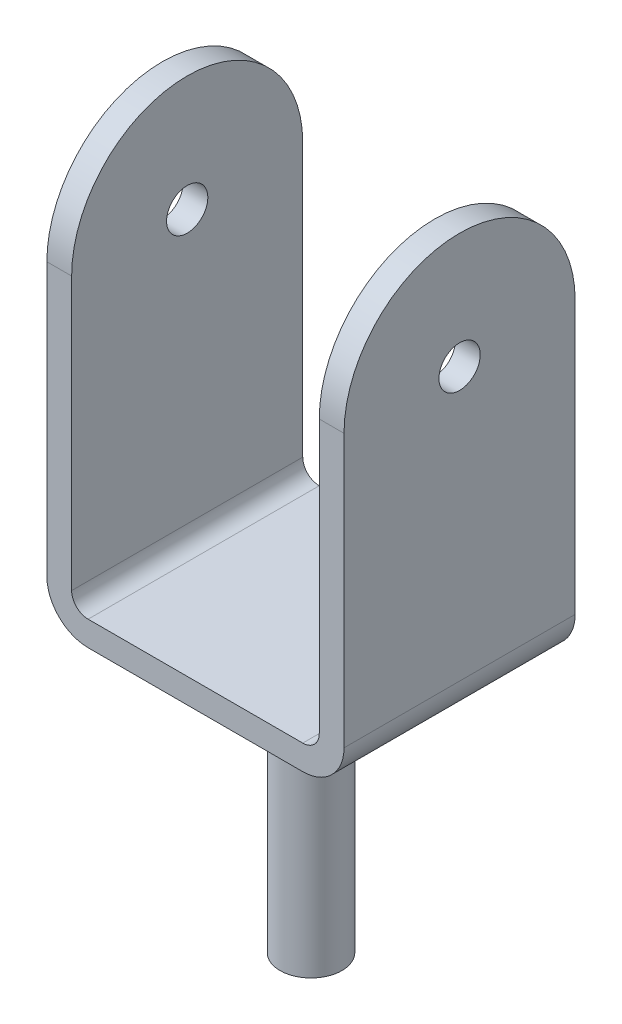
ISO-10303-21;
HEADER;
FILE_DESCRIPTION(('STEP AP214'),'2;1');
FILE_NAME('part.step','',(''),(''),'','','');
FILE_SCHEMA(('AUTOMOTIVE_DESIGN { 1 0 10303 214 1 1 1 1 }'));
ENDSEC;
DATA;
#1=APPLICATION_CONTEXT('core data for automotive mechanical design processes');
#2=APPLICATION_PROTOCOL_DEFINITION('international standard','automotive_design',2000,#1);
#3=PRODUCT_CONTEXT('',#1,'mechanical');
#4=PRODUCT('Part','Part','',(#3));
#5=PRODUCT_RELATED_PRODUCT_CATEGORY('part','',(#4));
#6=PRODUCT_DEFINITION_FORMATION('','',#4);
#7=PRODUCT_DEFINITION_CONTEXT('part definition',#1,'design');
#8=PRODUCT_DEFINITION('design','',#6,#7);
#9=PRODUCT_DEFINITION_SHAPE('','',#8);
#10=(LENGTH_UNIT() NAMED_UNIT(*) SI_UNIT(.MILLI.,.METRE.));
#11=(NAMED_UNIT(*) PLANE_ANGLE_UNIT() SI_UNIT($,.RADIAN.));
#12=(NAMED_UNIT(*) SI_UNIT($,.STERADIAN.) SOLID_ANGLE_UNIT());
#13=UNCERTAINTY_MEASURE_WITH_UNIT(LENGTH_MEASURE(1.E-05),#10,'distance_accuracy_value','');
#14=(GEOMETRIC_REPRESENTATION_CONTEXT(3) GLOBAL_UNCERTAINTY_ASSIGNED_CONTEXT((#13)) GLOBAL_UNIT_ASSIGNED_CONTEXT((#10,
#11,#12)) REPRESENTATION_CONTEXT('',''));
#15=CARTESIAN_POINT('',(0.,0.,0.));
#16=DIRECTION('',(0.,0.,1.));
#17=DIRECTION('',(1.,0.,0.));
#18=AXIS2_PLACEMENT_3D('',#15,#16,#17);
#19=CARTESIAN_POINT('',(180.,845.,140.));
#20=DIRECTION('',(-1.,0.,0.));
#21=DIRECTION('',(0.,0.,1.));
#22=AXIS2_PLACEMENT_3D('',#19,#20,#21);
#23=PLANE('',#22);
#24=CARTESIAN_POINT('',(180.,705.,0.));
#25=DIRECTION('',(1.,0.,0.));
#26=DIRECTION('',(0.,0.,-1.));
#27=AXIS2_PLACEMENT_3D('',#24,#25,#26);
#28=CIRCLE('',#27,25.);
#29=CARTESIAN_POINT('',(180.,705.,-25.));
#30=VERTEX_POINT('',#29);
#31=EDGE_CURVE('E262',#30,#30,#28,.T.);
#32=ORIENTED_EDGE('',*,*,#31,.F.);
#33=EDGE_LOOP('',(#32));
#34=FACE_BOUND('',#33,.T.);
#35=DIRECTION('',(0.,-1.,0.));
#36=VECTOR('',#35,1.);
#37=CARTESIAN_POINT('',(180.,845.,-140.));
#38=LINE('',#37,#36);
#39=CARTESIAN_POINT('',(180.,705.,-140.));
#40=VERTEX_POINT('',#39);
#41=CARTESIAN_POINT('',(180.,375.,-140.));
#42=VERTEX_POINT('',#41);
#43=EDGE_CURVE('E161',#40,#42,#38,.T.);
#44=ORIENTED_EDGE('',*,*,#43,.F.);
#45=CARTESIAN_POINT('',(180.,705.,0.));
#46=DIRECTION('',(1.,0.,0.));
#47=DIRECTION('',(0.,0.,-1.));
#48=AXIS2_PLACEMENT_3D('',#45,#46,#47);
#49=CIRCLE('',#48,140.);
#50=CARTESIAN_POINT('',(180.,705.,140.));
#51=VERTEX_POINT('',#50);
#52=EDGE_CURVE('E146',#40,#51,#49,.T.);
#53=ORIENTED_EDGE('',*,*,#52,.T.);
#54=DIRECTION('',(0.,-1.,0.));
#55=VECTOR('',#54,1.);
#56=CARTESIAN_POINT('',(180.,845.,140.));
#57=LINE('',#56,#55);
#58=CARTESIAN_POINT('',(180.,375.,140.));
#59=VERTEX_POINT('',#58);
#60=EDGE_CURVE('E233',#51,#59,#57,.T.);
#61=ORIENTED_EDGE('',*,*,#60,.T.);
#62=DIRECTION('',(0.,0.,-1.));
#63=VECTOR('',#62,1.);
#64=CARTESIAN_POINT('',(180.,375.,-140.));
#65=LINE('',#64,#63);
#66=EDGE_CURVE('E169',#59,#42,#65,.T.);
#67=ORIENTED_EDGE('',*,*,#66,.T.);
#68=EDGE_LOOP('',(#44,#53,#61,#67));
#69=FACE_BOUND('',#68,.T.);
#70=ADVANCED_FACE('F57',(#34,#69),#23,.F.);
#71=CARTESIAN_POINT('',(-180.,845.,140.));
#72=DIRECTION('',(1.,0.,0.));
#73=DIRECTION('',(0.,0.,-1.));
#74=AXIS2_PLACEMENT_3D('',#71,#72,#73);
#75=PLANE('',#74);
#76=CARTESIAN_POINT('',(-180.,705.,0.));
#77=DIRECTION('',(1.,0.,0.));
#78=DIRECTION('',(0.,0.,-1.));
#79=AXIS2_PLACEMENT_3D('',#76,#77,#78);
#80=CIRCLE('',#79,25.);
#81=CARTESIAN_POINT('',(-180.,705.,-25.));
#82=VERTEX_POINT('',#81);
#83=EDGE_CURVE('E165',#82,#82,#80,.T.);
#84=ORIENTED_EDGE('',*,*,#83,.T.);
#85=EDGE_LOOP('',(#84));
#86=FACE_BOUND('',#85,.T.);
#87=CARTESIAN_POINT('',(-180.,705.,0.));
#88=DIRECTION('',(1.,0.,0.));
#89=DIRECTION('',(0.,0.,-1.));
#90=AXIS2_PLACEMENT_3D('',#87,#88,#89);
#91=CIRCLE('',#90,140.);
#92=CARTESIAN_POINT('',(-180.,705.,-140.));
#93=VERTEX_POINT('',#92);
#94=CARTESIAN_POINT('',(-180.,705.,140.));
#95=VERTEX_POINT('',#94);
#96=EDGE_CURVE('E252',#93,#95,#91,.T.);
#97=ORIENTED_EDGE('',*,*,#96,.F.);
#98=DIRECTION('',(0.,-1.,0.));
#99=VECTOR('',#98,1.);
#100=CARTESIAN_POINT('',(-180.,845.,-140.));
#101=LINE('',#100,#99);
#102=CARTESIAN_POINT('',(-180.,375.,-140.));
#103=VERTEX_POINT('',#102);
#104=EDGE_CURVE('E171',#93,#103,#101,.T.);
#105=ORIENTED_EDGE('',*,*,#104,.T.);
#106=DIRECTION('',(0.,0.,1.));
#107=VECTOR('',#106,1.);
#108=CARTESIAN_POINT('',(-180.,375.,140.));
#109=LINE('',#108,#107);
#110=CARTESIAN_POINT('',(-180.,375.,140.));
#111=VERTEX_POINT('',#110);
#112=EDGE_CURVE('E66',#103,#111,#109,.T.);
#113=ORIENTED_EDGE('',*,*,#112,.T.);
#114=DIRECTION('',(0.,-1.,0.));
#115=VECTOR('',#114,1.);
#116=CARTESIAN_POINT('',(-180.,845.,140.));
#117=LINE('',#116,#115);
#118=EDGE_CURVE('E79',#95,#111,#117,.T.);
#119=ORIENTED_EDGE('',*,*,#118,.F.);
#120=EDGE_LOOP('',(#97,#105,#113,#119));
#121=FACE_BOUND('',#120,.T.);
#122=ADVANCED_FACE('F219',(#86,#121),#75,.F.);
#123=CARTESIAN_POINT('',(150.,0.,-227.));
#124=DIRECTION('',(-1.,0.,0.));
#125=DIRECTION('',(0.,-1.,0.));
#126=AXIS2_PLACEMENT_3D('',#123,#124,#125);
#127=PLANE('',#126);
#128=CARTESIAN_POINT('',(150.,705.,0.));
#129=DIRECTION('',(-1.,0.,0.));
#130=DIRECTION('',(0.,-1.,0.));
#131=AXIS2_PLACEMENT_3D('',#128,#129,#130);
#132=CIRCLE('',#131,25.);
#133=CARTESIAN_POINT('',(150.,680.,0.));
#134=VERTEX_POINT('',#133);
#135=EDGE_CURVE('E259',#134,#134,#132,.T.);
#136=ORIENTED_EDGE('',*,*,#135,.F.);
#137=EDGE_LOOP('',(#136));
#138=FACE_BOUND('',#137,.T.);
#139=CARTESIAN_POINT('',(150.,705.,0.));
#140=DIRECTION('',(-1.,0.,0.));
#141=DIRECTION('',(0.,-1.,0.));
#142=AXIS2_PLACEMENT_3D('',#139,#140,#141);
#143=CIRCLE('',#142,140.);
#144=CARTESIAN_POINT('',(150.,705.,140.));
#145=VERTEX_POINT('',#144);
#146=CARTESIAN_POINT('',(150.,705.,-140.));
#147=VERTEX_POINT('',#146);
#148=EDGE_CURVE('E254',#145,#147,#143,.T.);
#149=ORIENTED_EDGE('',*,*,#148,.T.);
#150=DIRECTION('',(0.,-1.,0.));
#151=VECTOR('',#150,1.);
#152=CARTESIAN_POINT('',(150.,845.,-140.));
#153=LINE('',#152,#151);
#154=CARTESIAN_POINT('',(150.,375.,-140.));
#155=VERTEX_POINT('',#154);
#156=EDGE_CURVE('E164',#147,#155,#153,.T.);
#157=ORIENTED_EDGE('',*,*,#156,.T.);
#158=DIRECTION('',(0.,0.,1.));
#159=VECTOR('',#158,1.);
#160=CARTESIAN_POINT('',(150.,375.,-227.));
#161=LINE('',#160,#159);
#162=CARTESIAN_POINT('',(150.,375.,140.));
#163=VERTEX_POINT('',#162);
#164=EDGE_CURVE('E180',#155,#163,#161,.T.);
#165=ORIENTED_EDGE('',*,*,#164,.T.);
#166=DIRECTION('',(0.,-1.,0.));
#167=VECTOR('',#166,1.);
#168=CARTESIAN_POINT('',(150.,0.,140.));
#169=LINE('',#168,#167);
#170=EDGE_CURVE('E250',#145,#163,#169,.T.);
#171=ORIENTED_EDGE('',*,*,#170,.F.);
#172=EDGE_LOOP('',(#149,#157,#165,#171));
#173=FACE_BOUND('',#172,.T.);
#174=ADVANCED_FACE('F280',(#138,#173),#127,.T.);
#175=CARTESIAN_POINT('',(-150.,0.,-227.));
#176=DIRECTION('',(-1.,0.,0.));
#177=DIRECTION('',(0.,-1.,0.));
#178=AXIS2_PLACEMENT_3D('',#175,#176,#177);
#179=PLANE('',#178);
#180=CARTESIAN_POINT('',(-150.,705.,0.));
#181=DIRECTION('',(-1.,0.,0.));
#182=DIRECTION('',(0.,-1.,0.));
#183=AXIS2_PLACEMENT_3D('',#180,#181,#182);
#184=CIRCLE('',#183,25.);
#185=CARTESIAN_POINT('',(-150.,680.,0.));
#186=VERTEX_POINT('',#185);
#187=EDGE_CURVE('E61',#186,#186,#184,.T.);
#188=ORIENTED_EDGE('',*,*,#187,.T.);
#189=EDGE_LOOP('',(#188));
#190=FACE_BOUND('',#189,.T.);
#191=DIRECTION('',(0.,-1.,0.));
#192=VECTOR('',#191,1.);
#193=CARTESIAN_POINT('',(-150.,845.,-140.));
#194=LINE('',#193,#192);
#195=CARTESIAN_POINT('',(-150.,705.,-140.));
#196=VERTEX_POINT('',#195);
#197=CARTESIAN_POINT('',(-150.,375.,-140.));
#198=VERTEX_POINT('',#197);
#199=EDGE_CURVE('E243',#196,#198,#194,.T.);
#200=ORIENTED_EDGE('',*,*,#199,.F.);
#201=CARTESIAN_POINT('',(-150.,705.,0.));
#202=DIRECTION('',(-1.,0.,0.));
#203=DIRECTION('',(0.,-1.,0.));
#204=AXIS2_PLACEMENT_3D('',#201,#202,#203);
#205=CIRCLE('',#204,140.);
#206=CARTESIAN_POINT('',(-150.,705.,140.));
#207=VERTEX_POINT('',#206);
#208=EDGE_CURVE('E12',#207,#196,#205,.T.);
#209=ORIENTED_EDGE('',*,*,#208,.F.);
#210=DIRECTION('',(0.,-1.,0.));
#211=VECTOR('',#210,1.);
#212=CARTESIAN_POINT('',(-150.,0.,140.));
#213=LINE('',#212,#211);
#214=CARTESIAN_POINT('',(-150.,375.,140.));
#215=VERTEX_POINT('',#214);
#216=EDGE_CURVE('E248',#207,#215,#213,.T.);
#217=ORIENTED_EDGE('',*,*,#216,.T.);
#218=DIRECTION('',(0.,0.,1.));
#219=VECTOR('',#218,1.);
#220=CARTESIAN_POINT('',(-150.,375.,-140.));
#221=LINE('',#220,#219);
#222=EDGE_CURVE('E189',#215,#198,#221,.F.);
#223=ORIENTED_EDGE('',*,*,#222,.T.);
#224=EDGE_LOOP('',(#200,#209,#217,#223));
#225=FACE_BOUND('',#224,.T.);
#226=ADVANCED_FACE('F269',(#190,#225),#179,.F.);
#227=CARTESIAN_POINT('',(-180.,845.,140.));
#228=DIRECTION('',(0.,0.,-1.));
#229=DIRECTION('',(-1.,0.,0.));
#230=AXIS2_PLACEMENT_3D('',#227,#228,#229);
#231=PLANE('',#230);
#232=DIRECTION('',(1.,0.,0.));
#233=VECTOR('',#232,1.);
#234=CARTESIAN_POINT('',(-187.,705.,140.));
#235=LINE('',#234,#233);
#236=EDGE_CURVE('E72',#95,#207,#235,.T.);
#237=ORIENTED_EDGE('',*,*,#236,.F.);
#238=ORIENTED_EDGE('',*,*,#118,.T.);
#239=CARTESIAN_POINT('',(-130.,375.,140.));
#240=DIRECTION('',(0.,0.,-1.));
#241=DIRECTION('',(-1.,0.,0.));
#242=AXIS2_PLACEMENT_3D('',#239,#240,#241);
#243=CIRCLE('',#242,50.);
#244=CARTESIAN_POINT('',(-130.,325.,140.));
#245=VERTEX_POINT('',#244);
#246=EDGE_CURVE('E211',#111,#245,#243,.F.);
#247=ORIENTED_EDGE('',*,*,#246,.T.);
#248=DIRECTION('',(1.,0.,0.));
#249=VECTOR('',#248,1.);
#250=CARTESIAN_POINT('',(-180.,325.,140.));
#251=LINE('',#250,#249);
#252=CARTESIAN_POINT('',(130.,325.,140.));
#253=VERTEX_POINT('',#252);
#254=EDGE_CURVE('E226',#245,#253,#251,.T.);
#255=ORIENTED_EDGE('',*,*,#254,.T.);
#256=CARTESIAN_POINT('',(130.,375.,140.));
#257=DIRECTION('',(0.,0.,-1.));
#258=DIRECTION('',(-1.,0.,0.));
#259=AXIS2_PLACEMENT_3D('',#256,#257,#258);
#260=CIRCLE('',#259,50.);
#261=EDGE_CURVE('E213',#253,#59,#260,.F.);
#262=ORIENTED_EDGE('',*,*,#261,.T.);
#263=ORIENTED_EDGE('',*,*,#60,.F.);
#264=EDGE_CURVE('E152',#145,#51,#235,.T.);
#265=ORIENTED_EDGE('',*,*,#264,.F.);
#266=ORIENTED_EDGE('',*,*,#170,.T.);
#267=CARTESIAN_POINT('',(130.,375.,140.));
#268=DIRECTION('',(0.,0.,-1.));
#269=DIRECTION('',(-1.,0.,0.));
#270=AXIS2_PLACEMENT_3D('',#267,#268,#269);
#271=CIRCLE('',#270,20.);
#272=CARTESIAN_POINT('',(130.,355.,140.));
#273=VERTEX_POINT('',#272);
#274=EDGE_CURVE('E192',#163,#273,#271,.T.);
#275=ORIENTED_EDGE('',*,*,#274,.T.);
#276=DIRECTION('',(1.,0.,0.));
#277=VECTOR('',#276,1.);
#278=CARTESIAN_POINT('',(0.,355.,140.));
#279=LINE('',#278,#277);
#280=CARTESIAN_POINT('',(-130.,355.,140.));
#281=VERTEX_POINT('',#280);
#282=EDGE_CURVE('E245',#281,#273,#279,.T.);
#283=ORIENTED_EDGE('',*,*,#282,.F.);
#284=CARTESIAN_POINT('',(-130.,375.,140.));
#285=DIRECTION('',(0.,0.,-1.));
#286=DIRECTION('',(-1.,0.,0.));
#287=AXIS2_PLACEMENT_3D('',#284,#285,#286);
#288=CIRCLE('',#287,20.);
#289=EDGE_CURVE('E196',#281,#215,#288,.T.);
#290=ORIENTED_EDGE('',*,*,#289,.T.);
#291=ORIENTED_EDGE('',*,*,#216,.F.);
#292=EDGE_LOOP('',(#237,#238,#247,#255,#262,#263,#265,#266,#275,#283,#290,#291));
#293=FACE_BOUND('',#292,.T.);
#294=ADVANCED_FACE('F225',(#293),#231,.F.);
#295=CARTESIAN_POINT('',(-180.,845.,-140.));
#296=DIRECTION('',(0.,0.,1.));
#297=DIRECTION('',(1.,0.,0.));
#298=AXIS2_PLACEMENT_3D('',#295,#296,#297);
#299=PLANE('',#298);
#300=ORIENTED_EDGE('',*,*,#104,.F.);
#301=DIRECTION('',(1.,0.,0.));
#302=VECTOR('',#301,1.);
#303=CARTESIAN_POINT('',(-187.,705.,-140.));
#304=LINE('',#303,#302);
#305=EDGE_CURVE('E156',#93,#196,#304,.T.);
#306=ORIENTED_EDGE('',*,*,#305,.T.);
#307=ORIENTED_EDGE('',*,*,#199,.T.);
#308=CARTESIAN_POINT('',(-130.,375.,-140.));
#309=DIRECTION('',(0.,0.,1.));
#310=DIRECTION('',(1.,0.,0.));
#311=AXIS2_PLACEMENT_3D('',#308,#309,#310);
#312=CIRCLE('',#311,20.);
#313=CARTESIAN_POINT('',(-130.,355.,-140.));
#314=VERTEX_POINT('',#313);
#315=EDGE_CURVE('E199',#198,#314,#312,.T.);
#316=ORIENTED_EDGE('',*,*,#315,.T.);
#317=DIRECTION('',(1.,0.,0.));
#318=VECTOR('',#317,1.);
#319=CARTESIAN_POINT('',(-180.,355.,-140.));
#320=LINE('',#319,#318);
#321=CARTESIAN_POINT('',(130.,355.,-140.));
#322=VERTEX_POINT('',#321);
#323=EDGE_CURVE('E237',#314,#322,#320,.T.);
#324=ORIENTED_EDGE('',*,*,#323,.T.);
#325=CARTESIAN_POINT('',(130.,375.,-140.));
#326=DIRECTION('',(0.,0.,1.));
#327=DIRECTION('',(1.,0.,0.));
#328=AXIS2_PLACEMENT_3D('',#325,#326,#327);
#329=CIRCLE('',#328,20.);
#330=EDGE_CURVE('E194',#322,#155,#329,.T.);
#331=ORIENTED_EDGE('',*,*,#330,.T.);
#332=ORIENTED_EDGE('',*,*,#156,.F.);
#333=EDGE_CURVE('E149',#147,#40,#304,.T.);
#334=ORIENTED_EDGE('',*,*,#333,.T.);
#335=ORIENTED_EDGE('',*,*,#43,.T.);
#336=CARTESIAN_POINT('',(130.,375.,-140.));
#337=DIRECTION('',(0.,0.,1.));
#338=DIRECTION('',(1.,0.,0.));
#339=AXIS2_PLACEMENT_3D('',#336,#337,#338);
#340=CIRCLE('',#339,50.);
#341=CARTESIAN_POINT('',(130.,325.,-140.));
#342=VERTEX_POINT('',#341);
#343=EDGE_CURVE('E205',#42,#342,#340,.F.);
#344=ORIENTED_EDGE('',*,*,#343,.T.);
#345=DIRECTION('',(-1.,0.,0.));
#346=VECTOR('',#345,1.);
#347=CARTESIAN_POINT('',(-180.,325.,-140.));
#348=LINE('',#347,#346);
#349=CARTESIAN_POINT('',(-130.,325.,-140.));
#350=VERTEX_POINT('',#349);
#351=EDGE_CURVE('E234',#342,#350,#348,.T.);
#352=ORIENTED_EDGE('',*,*,#351,.T.);
#353=CARTESIAN_POINT('',(-130.,375.,-140.));
#354=DIRECTION('',(0.,0.,1.));
#355=DIRECTION('',(1.,0.,0.));
#356=AXIS2_PLACEMENT_3D('',#353,#354,#355);
#357=CIRCLE('',#356,50.);
#358=EDGE_CURVE('E202',#350,#103,#357,.F.);
#359=ORIENTED_EDGE('',*,*,#358,.T.);
#360=EDGE_LOOP('',(#300,#306,#307,#316,#324,#331,#332,#334,#335,#344,#352,#359));
#361=FACE_BOUND('',#360,.T.);
#362=ADVANCED_FACE('F160',(#361),#299,.F.);
#363=CARTESIAN_POINT('',(0.,325.,0.));
#364=DIRECTION('',(0.,-1.,0.));
#365=DIRECTION('',(0.,0.,-1.));
#366=AXIS2_PLACEMENT_3D('',#363,#364,#365);
#367=CYLINDRICAL_SURFACE('',#366,37.5);
#368=CARTESIAN_POINT('',(0.,325.,0.));
#369=DIRECTION('',(0.,1.,0.));
#370=DIRECTION('',(0.,0.,1.));
#371=AXIS2_PLACEMENT_3D('',#368,#369,#370);
#372=CIRCLE('',#371,37.5);
#373=CARTESIAN_POINT('',(0.,325.,37.5));
#374=VERTEX_POINT('',#373);
#375=EDGE_CURVE('E174',#374,#374,#372,.T.);
#376=ORIENTED_EDGE('',*,*,#375,.F.);
#377=EDGE_LOOP('',(#376));
#378=FACE_BOUND('',#377,.T.);
#379=CARTESIAN_POINT('',(0.,0.,0.));
#380=DIRECTION('',(0.,1.,0.));
#381=DIRECTION('',(0.,0.,1.));
#382=AXIS2_PLACEMENT_3D('',#379,#380,#381);
#383=CIRCLE('',#382,37.5);
#384=CARTESIAN_POINT('',(0.,0.,37.5));
#385=VERTEX_POINT('',#384);
#386=EDGE_CURVE('E170',#385,#385,#383,.T.);
#387=ORIENTED_EDGE('',*,*,#386,.T.);
#388=EDGE_LOOP('',(#387));
#389=FACE_BOUND('',#388,.T.);
#390=ADVANCED_FACE('F294',(#378,#389),#367,.T.);
#391=CARTESIAN_POINT('',(0.,0.,0.));
#392=DIRECTION('',(0.,1.,0.));
#393=DIRECTION('',(0.,0.,1.));
#394=AXIS2_PLACEMENT_3D('',#391,#392,#393);
#395=PLANE('',#394);
#396=ORIENTED_EDGE('',*,*,#386,.F.);
#397=EDGE_LOOP('',(#396));
#398=FACE_BOUND('',#397,.T.);
#399=ADVANCED_FACE('F296',(#398),#395,.F.);
#400=CARTESIAN_POINT('',(0.,325.,0.));
#401=DIRECTION('',(0.,-1.,0.));
#402=DIRECTION('',(0.,0.,-1.));
#403=AXIS2_PLACEMENT_3D('',#400,#401,#402);
#404=PLANE('',#403);
#405=ORIENTED_EDGE('',*,*,#375,.T.);
#406=EDGE_LOOP('',(#405));
#407=FACE_BOUND('',#406,.T.);
#408=ORIENTED_EDGE('',*,*,#351,.F.);
#409=DIRECTION('',(0.,0.,-1.));
#410=VECTOR('',#409,1.);
#411=CARTESIAN_POINT('',(130.,325.,140.));
#412=LINE('',#411,#410);
#413=EDGE_CURVE('E209',#342,#253,#412,.F.);
#414=ORIENTED_EDGE('',*,*,#413,.T.);
#415=ORIENTED_EDGE('',*,*,#254,.F.);
#416=DIRECTION('',(0.,0.,1.));
#417=VECTOR('',#416,1.);
#418=CARTESIAN_POINT('',(-130.,325.,-140.));
#419=LINE('',#418,#417);
#420=EDGE_CURVE('E207',#245,#350,#419,.F.);
#421=ORIENTED_EDGE('',*,*,#420,.T.);
#422=EDGE_LOOP('',(#408,#414,#415,#421));
#423=FACE_BOUND('',#422,.T.);
#424=ADVANCED_FACE('F230',(#407,#423),#404,.T.);
#425=CARTESIAN_POINT('',(0.,355.,-227.));
#426=DIRECTION('',(0.,-1.,0.));
#427=DIRECTION('',(0.,0.,-1.));
#428=AXIS2_PLACEMENT_3D('',#425,#426,#427);
#429=PLANE('',#428);
#430=ORIENTED_EDGE('',*,*,#282,.T.);
#431=DIRECTION('',(0.,0.,1.));
#432=VECTOR('',#431,1.);
#433=CARTESIAN_POINT('',(130.,355.,-227.));
#434=LINE('',#433,#432);
#435=EDGE_CURVE('E187',#273,#322,#434,.F.);
#436=ORIENTED_EDGE('',*,*,#435,.T.);
#437=ORIENTED_EDGE('',*,*,#323,.F.);
#438=DIRECTION('',(0.,0.,1.));
#439=VECTOR('',#438,1.);
#440=CARTESIAN_POINT('',(-130.,355.,140.));
#441=LINE('',#440,#439);
#442=EDGE_CURVE('E184',#314,#281,#441,.T.);
#443=ORIENTED_EDGE('',*,*,#442,.T.);
#444=EDGE_LOOP('',(#430,#436,#437,#443));
#445=FACE_BOUND('',#444,.T.);
#446=ADVANCED_FACE('F307',(#445),#429,.F.);
#447=CARTESIAN_POINT('',(130.,375.,-227.));
#448=DIRECTION('',(0.,0.,1.));
#449=DIRECTION('',(1.,0.,0.));
#450=AXIS2_PLACEMENT_3D('',#447,#448,#449);
#451=CYLINDRICAL_SURFACE('',#450,20.);
#452=ORIENTED_EDGE('',*,*,#330,.F.);
#453=ORIENTED_EDGE('',*,*,#435,.F.);
#454=ORIENTED_EDGE('',*,*,#274,.F.);
#455=ORIENTED_EDGE('',*,*,#164,.F.);
#456=EDGE_LOOP('',(#452,#453,#454,#455));
#457=FACE_BOUND('',#456,.T.);
#458=ADVANCED_FACE('F303',(#457),#451,.F.);
#459=CARTESIAN_POINT('',(-130.,375.,-227.));
#460=DIRECTION('',(0.,0.,-1.));
#461=DIRECTION('',(-1.,0.,0.));
#462=AXIS2_PLACEMENT_3D('',#459,#460,#461);
#463=CYLINDRICAL_SURFACE('',#462,20.);
#464=ORIENTED_EDGE('',*,*,#315,.F.);
#465=ORIENTED_EDGE('',*,*,#222,.F.);
#466=ORIENTED_EDGE('',*,*,#289,.F.);
#467=ORIENTED_EDGE('',*,*,#442,.F.);
#468=EDGE_LOOP('',(#464,#465,#466,#467));
#469=FACE_BOUND('',#468,.T.);
#470=ADVANCED_FACE('F306',(#469),#463,.F.);
#471=CARTESIAN_POINT('',(130.,375.,140.));
#472=DIRECTION('',(0.,0.,1.));
#473=DIRECTION('',(1.,0.,0.));
#474=AXIS2_PLACEMENT_3D('',#471,#472,#473);
#475=CYLINDRICAL_SURFACE('',#474,50.);
#476=ORIENTED_EDGE('',*,*,#261,.F.);
#477=ORIENTED_EDGE('',*,*,#413,.F.);
#478=ORIENTED_EDGE('',*,*,#343,.F.);
#479=ORIENTED_EDGE('',*,*,#66,.F.);
#480=EDGE_LOOP('',(#476,#477,#478,#479));
#481=FACE_BOUND('',#480,.T.);
#482=ADVANCED_FACE('F310',(#481),#475,.T.);
#483=CARTESIAN_POINT('',(-130.,375.,140.));
#484=DIRECTION('',(0.,0.,-1.));
#485=DIRECTION('',(-1.,0.,0.));
#486=AXIS2_PLACEMENT_3D('',#483,#484,#485);
#487=CYLINDRICAL_SURFACE('',#486,50.);
#488=ORIENTED_EDGE('',*,*,#358,.F.);
#489=ORIENTED_EDGE('',*,*,#420,.F.);
#490=ORIENTED_EDGE('',*,*,#246,.F.);
#491=ORIENTED_EDGE('',*,*,#112,.F.);
#492=EDGE_LOOP('',(#488,#489,#490,#491));
#493=FACE_BOUND('',#492,.T.);
#494=ADVANCED_FACE('F59',(#493),#487,.T.);
#495=CARTESIAN_POINT('',(-187.,705.,0.));
#496=DIRECTION('',(1.,0.,0.));
#497=DIRECTION('',(0.,0.,-1.));
#498=AXIS2_PLACEMENT_3D('',#495,#496,#497);
#499=CYLINDRICAL_SURFACE('',#498,140.);
#500=ORIENTED_EDGE('',*,*,#96,.T.);
#501=ORIENTED_EDGE('',*,*,#236,.T.);
#502=ORIENTED_EDGE('',*,*,#208,.T.);
#503=ORIENTED_EDGE('',*,*,#305,.F.);
#504=EDGE_LOOP('',(#500,#501,#502,#503));
#505=FACE_BOUND('',#504,.T.);
#506=ADVANCED_FACE('F317',(#505),#499,.T.);
#507=ORIENTED_EDGE('',*,*,#264,.T.);
#508=ORIENTED_EDGE('',*,*,#52,.F.);
#509=ORIENTED_EDGE('',*,*,#333,.F.);
#510=ORIENTED_EDGE('',*,*,#148,.F.);
#511=EDGE_LOOP('',(#507,#508,#509,#510));
#512=FACE_BOUND('',#511,.T.);
#513=ADVANCED_FACE('F148',(#512),#499,.T.);
#514=CARTESIAN_POINT('',(-187.,705.,0.));
#515=DIRECTION('',(1.,0.,0.));
#516=DIRECTION('',(0.,0.,-1.));
#517=AXIS2_PLACEMENT_3D('',#514,#515,#516);
#518=CYLINDRICAL_SURFACE('',#517,25.);
#519=ORIENTED_EDGE('',*,*,#187,.F.);
#520=EDGE_LOOP('',(#519));
#521=FACE_BOUND('',#520,.T.);
#522=ORIENTED_EDGE('',*,*,#83,.F.);
#523=EDGE_LOOP('',(#522));
#524=FACE_BOUND('',#523,.T.);
#525=ADVANCED_FACE('F272',(#521,#524),#518,.F.);
#526=ORIENTED_EDGE('',*,*,#135,.T.);
#527=EDGE_LOOP('',(#526));
#528=FACE_BOUND('',#527,.T.);
#529=ORIENTED_EDGE('',*,*,#31,.T.);
#530=EDGE_LOOP('',(#529));
#531=FACE_BOUND('',#530,.T.);
#532=ADVANCED_FACE('F275',(#528,#531),#518,.F.);
#533=CLOSED_SHELL('',(#70,#122,#174,#226,#294,#362,#390,#399,#424,#446,#458,#470,#482,#494,#506,
#513,#525,#532));
#534=MANIFOLD_SOLID_BREP('B2',#533);
#535=ADVANCED_BREP_SHAPE_REPRESENTATION('',(#18,#534),#14);
#536=SHAPE_DEFINITION_REPRESENTATION(#9,#535);
ENDSEC;
END-ISO-10303-21;
